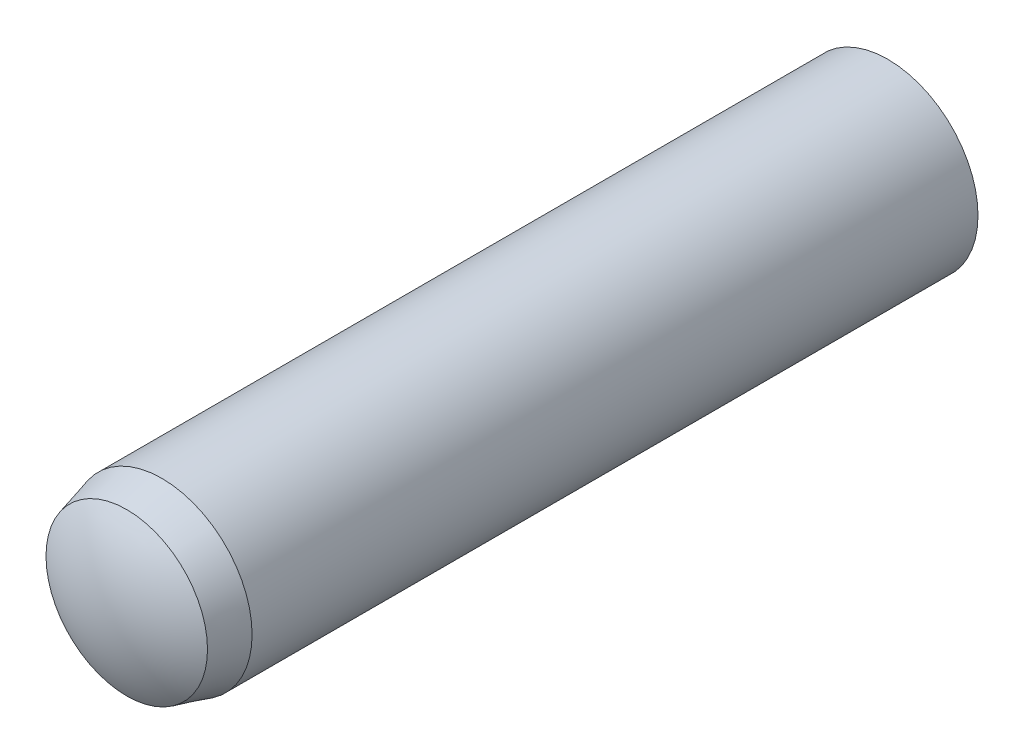
ISO-10303-21;
HEADER;
FILE_DESCRIPTION(('STEP AP214'),'2;1');
FILE_NAME('part.step','',(''),(''),'','','');
FILE_SCHEMA(('AUTOMOTIVE_DESIGN { 1 0 10303 214 1 1 1 1 }'));
ENDSEC;
DATA;
#1=APPLICATION_CONTEXT('core data for automotive mechanical design processes');
#2=APPLICATION_PROTOCOL_DEFINITION('international standard','automotive_design',2000,#1);
#3=PRODUCT_CONTEXT('',#1,'mechanical');
#4=PRODUCT('Part','Part','',(#3));
#5=PRODUCT_RELATED_PRODUCT_CATEGORY('part','',(#4));
#6=PRODUCT_DEFINITION_FORMATION('','',#4);
#7=PRODUCT_DEFINITION_CONTEXT('part definition',#1,'design');
#8=PRODUCT_DEFINITION('design','',#6,#7);
#9=PRODUCT_DEFINITION_SHAPE('','',#8);
#10=(LENGTH_UNIT() NAMED_UNIT(*) SI_UNIT(.MILLI.,.METRE.));
#11=(NAMED_UNIT(*) PLANE_ANGLE_UNIT() SI_UNIT($,.RADIAN.));
#12=(NAMED_UNIT(*) SI_UNIT($,.STERADIAN.) SOLID_ANGLE_UNIT());
#13=UNCERTAINTY_MEASURE_WITH_UNIT(LENGTH_MEASURE(1.E-05),#10,'distance_accuracy_value','');
#14=(GEOMETRIC_REPRESENTATION_CONTEXT(3) GLOBAL_UNCERTAINTY_ASSIGNED_CONTEXT((#13)) GLOBAL_UNIT_ASSIGNED_CONTEXT((#10,
#11,#12)) REPRESENTATION_CONTEXT('',''));
#15=CARTESIAN_POINT('',(0.,0.,0.));
#16=DIRECTION('',(0.,0.,1.));
#17=DIRECTION('',(1.,0.,0.));
#18=AXIS2_PLACEMENT_3D('',#15,#16,#17);
#19=CARTESIAN_POINT('',(0.,0.,-10.7333333333334));
#20=DIRECTION('',(0.,0.,1.));
#21=DIRECTION('',(0.,-1.,0.));
#22=AXIS2_PLACEMENT_3D('',#19,#20,#21);
#23=SPHERICAL_SURFACE('',#22,7.26666666666662);
#24=CARTESIAN_POINT('',(0.,0.,-16.8));
#25=DIRECTION('',(0.,0.,1.));
#26=DIRECTION('',(0.,-1.,0.));
#27=AXIS2_PLACEMENT_3D('',#24,#25,#26);
#28=CIRCLE('',#27,4.);
#29=CARTESIAN_POINT('',(0.,-3.99999999999999,-16.8));
#30=VERTEX_POINT('',#29);
#31=EDGE_CURVE('E10',#30,#30,#28,.T.);
#32=ORIENTED_EDGE('',*,*,#31,.F.);
#33=EDGE_LOOP('',(#32));
#34=FACE_BOUND('',#33,.T.);
#35=ADVANCED_FACE('F32',(#34),#23,.T.);
#36=CARTESIAN_POINT('',(0.,0.,18.));
#37=DIRECTION('',(0.,0.,1.));
#38=DIRECTION('',(0.,-1.,0.));
#39=AXIS2_PLACEMENT_3D('',#36,#37,#38);
#40=CYLINDRICAL_SURFACE('',#39,4.);
#41=CARTESIAN_POINT('',(0.,0.,15.4));
#42=DIRECTION('',(0.,0.,1.));
#43=DIRECTION('',(0.,-1.,0.));
#44=AXIS2_PLACEMENT_3D('',#41,#42,#43);
#45=CIRCLE('',#44,4.);
#46=CARTESIAN_POINT('',(0.,-4.,15.4));
#47=VERTEX_POINT('',#46);
#48=EDGE_CURVE('E38',#47,#47,#45,.T.);
#49=ORIENTED_EDGE('',*,*,#48,.F.);
#50=EDGE_LOOP('',(#49));
#51=FACE_BOUND('',#50,.T.);
#52=ORIENTED_EDGE('',*,*,#31,.T.);
#53=EDGE_LOOP('',(#52));
#54=FACE_BOUND('',#53,.T.);
#55=ADVANCED_FACE('F53',(#51,#54),#40,.T.);
#56=CARTESIAN_POINT('',(0.,0.,15.4));
#57=DIRECTION('',(0.,0.,-1.));
#58=DIRECTION('',(0.,1.,0.));
#59=AXIS2_PLACEMENT_3D('',#56,#57,#58);
#60=CONICAL_SURFACE('',#59,4.,0.261799387799149);
#61=CARTESIAN_POINT('',(0.,0.,16.96));
#62=DIRECTION('',(0.,0.,1.));
#63=DIRECTION('',(0.,-1.,0.));
#64=AXIS2_PLACEMENT_3D('',#61,#62,#63);
#65=CIRCLE('',#64,3.58199925980745);
#66=CARTESIAN_POINT('',(0.,-3.58199925980745,16.96));
#67=VERTEX_POINT('',#66);
#68=EDGE_CURVE('E42',#67,#67,#65,.T.);
#69=ORIENTED_EDGE('',*,*,#68,.F.);
#70=EDGE_LOOP('',(#69));
#71=FACE_BOUND('',#70,.T.);
#72=ORIENTED_EDGE('',*,*,#48,.T.);
#73=EDGE_LOOP('',(#72));
#74=FACE_BOUND('',#73,.T.);
#75=ADVANCED_FACE('F51',(#71,#74),#60,.T.);
#76=CARTESIAN_POINT('',(0.,0.,11.3113852417014));
#77=DIRECTION('',(0.,0.,1.));
#78=DIRECTION('',(0.,1.,0.));
#79=AXIS2_PLACEMENT_3D('',#76,#77,#78);
#80=SPHERICAL_SURFACE('',#79,6.6886147582986);
#81=ORIENTED_EDGE('',*,*,#68,.T.);
#82=EDGE_LOOP('',(#81));
#83=FACE_BOUND('',#82,.T.);
#84=ADVANCED_FACE('F49',(#83),#80,.T.);
#85=CLOSED_SHELL('',(#35,#55,#75,#84));
#86=MANIFOLD_SOLID_BREP('B2',#85);
#87=ADVANCED_BREP_SHAPE_REPRESENTATION('',(#18,#86),#14);
#88=SHAPE_DEFINITION_REPRESENTATION(#9,#87);
ENDSEC;
END-ISO-10303-21;
